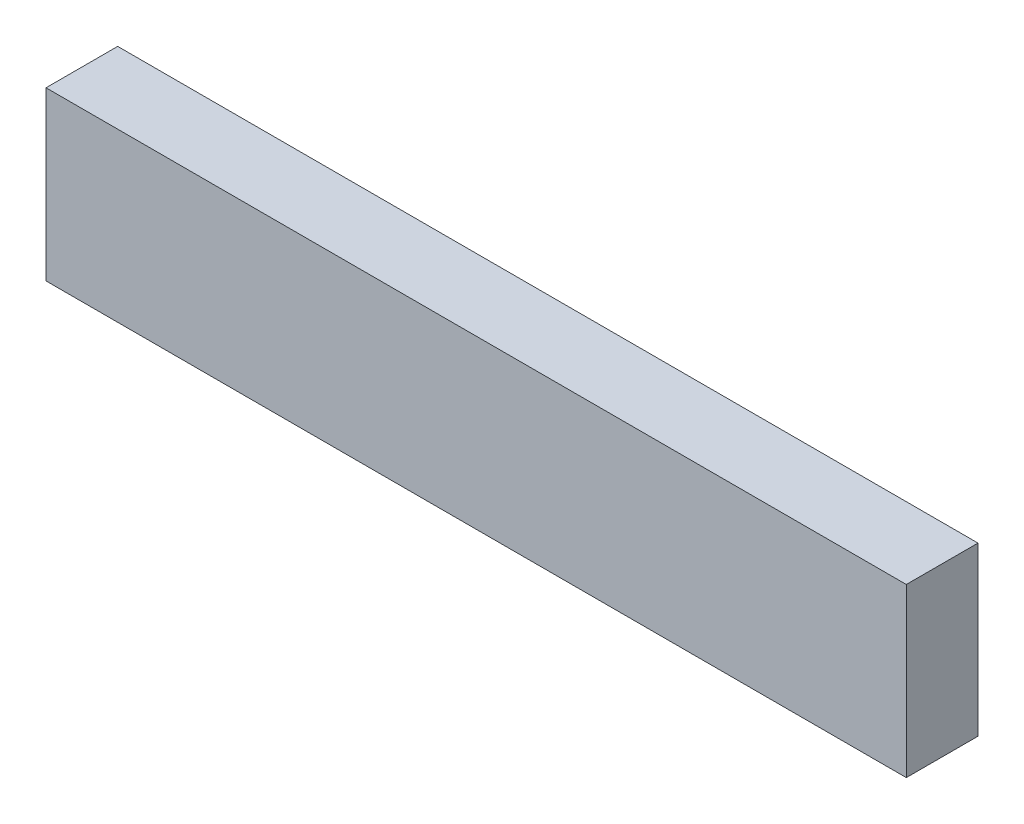
ISO-10303-21;
HEADER;
FILE_DESCRIPTION(('STEP AP214'),'2;1');
FILE_NAME('part.step','',(''),(''),'','','');
FILE_SCHEMA(('AUTOMOTIVE_DESIGN { 1 0 10303 214 1 1 1 1 }'));
ENDSEC;
DATA;
#1=APPLICATION_CONTEXT('core data for automotive mechanical design processes');
#2=APPLICATION_PROTOCOL_DEFINITION('international standard','automotive_design',2000,#1);
#3=PRODUCT_CONTEXT('',#1,'mechanical');
#4=PRODUCT('Part','Part','',(#3));
#5=PRODUCT_RELATED_PRODUCT_CATEGORY('part','',(#4));
#6=PRODUCT_DEFINITION_FORMATION('','',#4);
#7=PRODUCT_DEFINITION_CONTEXT('part definition',#1,'design');
#8=PRODUCT_DEFINITION('design','',#6,#7);
#9=PRODUCT_DEFINITION_SHAPE('','',#8);
#10=(LENGTH_UNIT() NAMED_UNIT(*) SI_UNIT(.MILLI.,.METRE.));
#11=(NAMED_UNIT(*) PLANE_ANGLE_UNIT() SI_UNIT($,.RADIAN.));
#12=(NAMED_UNIT(*) SI_UNIT($,.STERADIAN.) SOLID_ANGLE_UNIT());
#13=UNCERTAINTY_MEASURE_WITH_UNIT(LENGTH_MEASURE(1.E-05),#10,'distance_accuracy_value','');
#14=(GEOMETRIC_REPRESENTATION_CONTEXT(3) GLOBAL_UNCERTAINTY_ASSIGNED_CONTEXT((#13)) GLOBAL_UNIT_ASSIGNED_CONTEXT((#10,
#11,#12)) REPRESENTATION_CONTEXT('',''));
#15=CARTESIAN_POINT('',(0.,0.,0.));
#16=DIRECTION('',(0.,0.,1.));
#17=DIRECTION('',(1.,0.,0.));
#18=AXIS2_PLACEMENT_3D('',#15,#16,#17);
#19=CARTESIAN_POINT('',(228.6,44.45,38.1));
#20=DIRECTION('',(-1.,0.,0.));
#21=DIRECTION('',(0.,0.,1.));
#22=AXIS2_PLACEMENT_3D('',#19,#20,#21);
#23=PLANE('',#22);
#24=DIRECTION('',(0.,1.,0.));
#25=VECTOR('',#24,1.);
#26=CARTESIAN_POINT('',(228.6,44.45,0.));
#27=LINE('',#26,#25);
#28=CARTESIAN_POINT('',(228.6,-44.45,0.));
#29=VERTEX_POINT('',#28);
#30=CARTESIAN_POINT('',(228.6,44.45,0.));
#31=VERTEX_POINT('',#30);
#32=EDGE_CURVE('E96',#29,#31,#27,.T.);
#33=ORIENTED_EDGE('',*,*,#32,.T.);
#34=DIRECTION('',(0.,0.,-1.));
#35=VECTOR('',#34,1.);
#36=CARTESIAN_POINT('',(228.6,44.45,38.1));
#37=LINE('',#36,#35);
#38=CARTESIAN_POINT('',(228.6,44.45,38.1));
#39=VERTEX_POINT('',#38);
#40=EDGE_CURVE('E11',#39,#31,#37,.T.);
#41=ORIENTED_EDGE('',*,*,#40,.F.);
#42=DIRECTION('',(0.,1.,0.));
#43=VECTOR('',#42,1.);
#44=CARTESIAN_POINT('',(228.6,44.45,38.1));
#45=LINE('',#44,#43);
#46=CARTESIAN_POINT('',(228.6,-44.45,38.1));
#47=VERTEX_POINT('',#46);
#48=EDGE_CURVE('E84',#47,#39,#45,.T.);
#49=ORIENTED_EDGE('',*,*,#48,.F.);
#50=DIRECTION('',(0.,0.,-1.));
#51=VECTOR('',#50,1.);
#52=CARTESIAN_POINT('',(228.6,-44.45,38.1));
#53=LINE('',#52,#51);
#54=EDGE_CURVE('E92',#47,#29,#53,.T.);
#55=ORIENTED_EDGE('',*,*,#54,.T.);
#56=EDGE_LOOP('',(#33,#41,#49,#55));
#57=FACE_BOUND('',#56,.T.);
#58=ADVANCED_FACE('F33',(#57),#23,.F.);
#59=CARTESIAN_POINT('',(-228.6,44.45,38.1));
#60=DIRECTION('',(0.,-1.,0.));
#61=DIRECTION('',(0.,0.,-1.));
#62=AXIS2_PLACEMENT_3D('',#59,#60,#61);
#63=PLANE('',#62);
#64=DIRECTION('',(-1.,0.,0.));
#65=VECTOR('',#64,1.);
#66=CARTESIAN_POINT('',(-228.6,44.45,0.));
#67=LINE('',#66,#65);
#68=CARTESIAN_POINT('',(-228.6,44.45,0.));
#69=VERTEX_POINT('',#68);
#70=EDGE_CURVE('E88',#31,#69,#67,.T.);
#71=ORIENTED_EDGE('',*,*,#70,.T.);
#72=DIRECTION('',(0.,0.,-1.));
#73=VECTOR('',#72,1.);
#74=CARTESIAN_POINT('',(-228.6,44.45,38.1));
#75=LINE('',#74,#73);
#76=CARTESIAN_POINT('',(-228.6,44.45,38.1));
#77=VERTEX_POINT('',#76);
#78=EDGE_CURVE('E41',#77,#69,#75,.T.);
#79=ORIENTED_EDGE('',*,*,#78,.F.);
#80=DIRECTION('',(-1.,0.,0.));
#81=VECTOR('',#80,1.);
#82=CARTESIAN_POINT('',(-228.6,44.45,38.1));
#83=LINE('',#82,#81);
#84=EDGE_CURVE('E79',#39,#77,#83,.T.);
#85=ORIENTED_EDGE('',*,*,#84,.F.);
#86=ORIENTED_EDGE('',*,*,#40,.T.);
#87=EDGE_LOOP('',(#71,#79,#85,#86));
#88=FACE_BOUND('',#87,.T.);
#89=ADVANCED_FACE('F87',(#88),#63,.F.);
#90=CARTESIAN_POINT('',(-228.6,44.45,38.1));
#91=DIRECTION('',(1.,0.,0.));
#92=DIRECTION('',(0.,0.,-1.));
#93=AXIS2_PLACEMENT_3D('',#90,#91,#92);
#94=PLANE('',#93);
#95=DIRECTION('',(0.,-1.,0.));
#96=VECTOR('',#95,1.);
#97=CARTESIAN_POINT('',(-228.6,44.45,0.));
#98=LINE('',#97,#96);
#99=CARTESIAN_POINT('',(-228.6,-44.45,0.));
#100=VERTEX_POINT('',#99);
#101=EDGE_CURVE('E66',#69,#100,#98,.T.);
#102=ORIENTED_EDGE('',*,*,#101,.T.);
#103=DIRECTION('',(0.,0.,-1.));
#104=VECTOR('',#103,1.);
#105=CARTESIAN_POINT('',(-228.6,-44.45,38.1));
#106=LINE('',#105,#104);
#107=CARTESIAN_POINT('',(-228.6,-44.45,38.1));
#108=VERTEX_POINT('',#107);
#109=EDGE_CURVE('E89',#108,#100,#106,.T.);
#110=ORIENTED_EDGE('',*,*,#109,.F.);
#111=DIRECTION('',(0.,-1.,0.));
#112=VECTOR('',#111,1.);
#113=CARTESIAN_POINT('',(-228.6,44.45,38.1));
#114=LINE('',#113,#112);
#115=EDGE_CURVE('E82',#77,#108,#114,.T.);
#116=ORIENTED_EDGE('',*,*,#115,.F.);
#117=ORIENTED_EDGE('',*,*,#78,.T.);
#118=EDGE_LOOP('',(#102,#110,#116,#117));
#119=FACE_BOUND('',#118,.T.);
#120=ADVANCED_FACE('F90',(#119),#94,.F.);
#121=CARTESIAN_POINT('',(-228.6,-44.45,38.1));
#122=DIRECTION('',(0.,1.,0.));
#123=DIRECTION('',(0.,0.,1.));
#124=AXIS2_PLACEMENT_3D('',#121,#122,#123);
#125=PLANE('',#124);
#126=DIRECTION('',(1.,0.,0.));
#127=VECTOR('',#126,1.);
#128=CARTESIAN_POINT('',(-228.6,-44.45,0.));
#129=LINE('',#128,#127);
#130=EDGE_CURVE('E72',#100,#29,#129,.T.);
#131=ORIENTED_EDGE('',*,*,#130,.T.);
#132=ORIENTED_EDGE('',*,*,#54,.F.);
#133=DIRECTION('',(1.,0.,0.));
#134=VECTOR('',#133,1.);
#135=CARTESIAN_POINT('',(-228.6,-44.45,38.1));
#136=LINE('',#135,#134);
#137=EDGE_CURVE('E49',#108,#47,#136,.T.);
#138=ORIENTED_EDGE('',*,*,#137,.F.);
#139=ORIENTED_EDGE('',*,*,#109,.T.);
#140=EDGE_LOOP('',(#131,#132,#138,#139));
#141=FACE_BOUND('',#140,.T.);
#142=ADVANCED_FACE('F103',(#141),#125,.F.);
#143=CARTESIAN_POINT('',(0.,0.,38.1));
#144=DIRECTION('',(0.,0.,1.));
#145=DIRECTION('',(1.,0.,0.));
#146=AXIS2_PLACEMENT_3D('',#143,#144,#145);
#147=PLANE('',#146);
#148=ORIENTED_EDGE('',*,*,#48,.T.);
#149=ORIENTED_EDGE('',*,*,#84,.T.);
#150=ORIENTED_EDGE('',*,*,#115,.T.);
#151=ORIENTED_EDGE('',*,*,#137,.T.);
#152=EDGE_LOOP('',(#148,#149,#150,#151));
#153=FACE_BOUND('',#152,.T.);
#154=ADVANCED_FACE('F80',(#153),#147,.T.);
#155=CARTESIAN_POINT('',(0.,0.,0.));
#156=DIRECTION('',(0.,0.,1.));
#157=DIRECTION('',(1.,0.,0.));
#158=AXIS2_PLACEMENT_3D('',#155,#156,#157);
#159=PLANE('',#158);
#160=ORIENTED_EDGE('',*,*,#32,.F.);
#161=ORIENTED_EDGE('',*,*,#130,.F.);
#162=ORIENTED_EDGE('',*,*,#101,.F.);
#163=ORIENTED_EDGE('',*,*,#70,.F.);
#164=EDGE_LOOP('',(#160,#161,#162,#163));
#165=FACE_BOUND('',#164,.T.);
#166=ADVANCED_FACE('F106',(#165),#159,.F.);
#167=CLOSED_SHELL('',(#58,#89,#120,#142,#154,#166));
#168=MANIFOLD_SOLID_BREP('B2',#167);
#169=ADVANCED_BREP_SHAPE_REPRESENTATION('',(#18,#168),#14);
#170=SHAPE_DEFINITION_REPRESENTATION(#9,#169);
ENDSEC;
END-ISO-10303-21;
